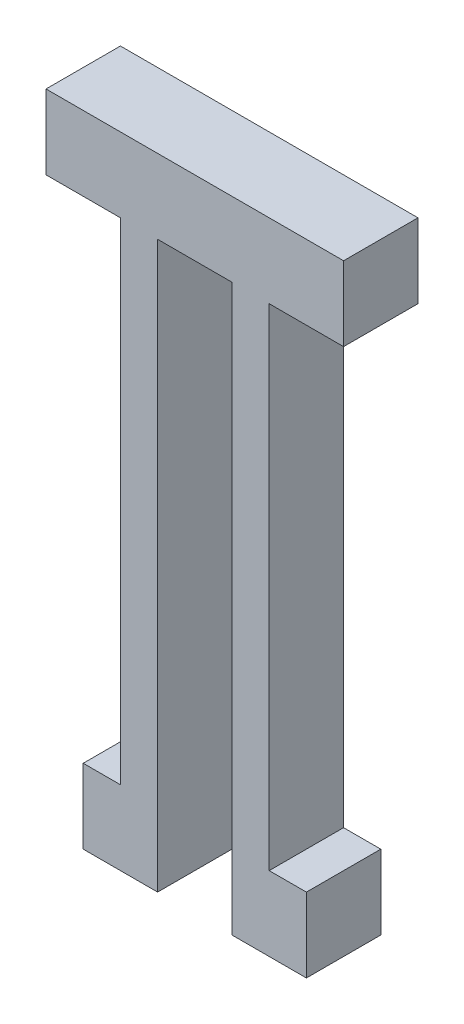
ISO-10303-21;
HEADER;
FILE_DESCRIPTION(('STEP AP214'),'2;1');
FILE_NAME('part.step','',(''),(''),'','','');
FILE_SCHEMA(('AUTOMOTIVE_DESIGN { 1 0 10303 214 1 1 1 1 }'));
ENDSEC;
DATA;
#1=APPLICATION_CONTEXT('core data for automotive mechanical design processes');
#2=APPLICATION_PROTOCOL_DEFINITION('international standard','automotive_design',2000,#1);
#3=PRODUCT_CONTEXT('',#1,'mechanical');
#4=PRODUCT('Part','Part','',(#3));
#5=PRODUCT_RELATED_PRODUCT_CATEGORY('part','',(#4));
#6=PRODUCT_DEFINITION_FORMATION('','',#4);
#7=PRODUCT_DEFINITION_CONTEXT('part definition',#1,'design');
#8=PRODUCT_DEFINITION('design','',#6,#7);
#9=PRODUCT_DEFINITION_SHAPE('','',#8);
#10=(LENGTH_UNIT() NAMED_UNIT(*) SI_UNIT(.MILLI.,.METRE.));
#11=(NAMED_UNIT(*) PLANE_ANGLE_UNIT() SI_UNIT($,.RADIAN.));
#12=(NAMED_UNIT(*) SI_UNIT($,.STERADIAN.) SOLID_ANGLE_UNIT());
#13=UNCERTAINTY_MEASURE_WITH_UNIT(LENGTH_MEASURE(1.E-05),#10,'distance_accuracy_value','');
#14=(GEOMETRIC_REPRESENTATION_CONTEXT(3) GLOBAL_UNCERTAINTY_ASSIGNED_CONTEXT((#13)) GLOBAL_UNIT_ASSIGNED_CONTEXT((#10,
#11,#12)) REPRESENTATION_CONTEXT('',''));
#15=CARTESIAN_POINT('',(0.,0.,0.));
#16=DIRECTION('',(0.,0.,1.));
#17=DIRECTION('',(1.,0.,0.));
#18=AXIS2_PLACEMENT_3D('',#15,#16,#17);
#19=CARTESIAN_POINT('',(0.,0.,6.35));
#20=DIRECTION('',(1.,0.,0.));
#21=DIRECTION('',(0.,0.,-1.));
#22=AXIS2_PLACEMENT_3D('',#19,#20,#21);
#23=PLANE('',#22);
#24=DIRECTION('',(0.,-1.,0.));
#25=VECTOR('',#24,1.);
#26=CARTESIAN_POINT('',(0.,0.,0.));
#27=LINE('',#26,#25);
#28=CARTESIAN_POINT('',(0.,6.34999999999999,0.));
#29=VERTEX_POINT('',#28);
#30=CARTESIAN_POINT('',(0.,0.,0.));
#31=VERTEX_POINT('',#30);
#32=EDGE_CURVE('E177',#29,#31,#27,.T.);
#33=ORIENTED_EDGE('',*,*,#32,.T.);
#34=DIRECTION('',(0.,0.,-1.));
#35=VECTOR('',#34,1.);
#36=CARTESIAN_POINT('',(0.,0.,6.35));
#37=LINE('',#36,#35);
#38=CARTESIAN_POINT('',(0.,0.,6.35));
#39=VERTEX_POINT('',#38);
#40=EDGE_CURVE('E11',#39,#31,#37,.T.);
#41=ORIENTED_EDGE('',*,*,#40,.F.);
#42=DIRECTION('',(0.,-1.,0.));
#43=VECTOR('',#42,1.);
#44=CARTESIAN_POINT('',(0.,0.,6.35));
#45=LINE('',#44,#43);
#46=CARTESIAN_POINT('',(0.,6.34999999999999,6.35));
#47=VERTEX_POINT('',#46);
#48=EDGE_CURVE('E209',#47,#39,#45,.T.);
#49=ORIENTED_EDGE('',*,*,#48,.F.);
#50=DIRECTION('',(0.,0.,-1.));
#51=VECTOR('',#50,1.);
#52=CARTESIAN_POINT('',(0.,6.34999999999999,6.35));
#53=LINE('',#52,#51);
#54=EDGE_CURVE('E173',#47,#29,#53,.T.);
#55=ORIENTED_EDGE('',*,*,#54,.T.);
#56=EDGE_LOOP('',(#33,#41,#49,#55));
#57=FACE_BOUND('',#56,.T.);
#58=ADVANCED_FACE('F33',(#57),#23,.F.);
#59=CARTESIAN_POINT('',(0.,0.,6.35));
#60=DIRECTION('',(0.,1.,0.));
#61=DIRECTION('',(0.,0.,1.));
#62=AXIS2_PLACEMENT_3D('',#59,#60,#61);
#63=PLANE('',#62);
#64=DIRECTION('',(1.,0.,0.));
#65=VECTOR('',#64,1.);
#66=CARTESIAN_POINT('',(0.,0.,0.));
#67=LINE('',#66,#65);
#68=CARTESIAN_POINT('',(6.35,0.,0.));
#69=VERTEX_POINT('',#68);
#70=EDGE_CURVE('E180',#31,#69,#67,.T.);
#71=ORIENTED_EDGE('',*,*,#70,.T.);
#72=DIRECTION('',(0.,0.,-1.));
#73=VECTOR('',#72,1.);
#74=CARTESIAN_POINT('',(6.35,0.,6.35));
#75=LINE('',#74,#73);
#76=CARTESIAN_POINT('',(6.35,0.,6.35));
#77=VERTEX_POINT('',#76);
#78=EDGE_CURVE('E41',#77,#69,#75,.T.);
#79=ORIENTED_EDGE('',*,*,#78,.F.);
#80=DIRECTION('',(1.,0.,0.));
#81=VECTOR('',#80,1.);
#82=CARTESIAN_POINT('',(0.,0.,6.35));
#83=LINE('',#82,#81);
#84=EDGE_CURVE('E116',#39,#77,#83,.T.);
#85=ORIENTED_EDGE('',*,*,#84,.F.);
#86=ORIENTED_EDGE('',*,*,#40,.T.);
#87=EDGE_LOOP('',(#71,#79,#85,#86));
#88=FACE_BOUND('',#87,.T.);
#89=ADVANCED_FACE('F306',(#88),#63,.F.);
#90=CARTESIAN_POINT('',(6.35,0.,6.35));
#91=DIRECTION('',(1.,0.,0.));
#92=DIRECTION('',(0.,1.,0.));
#93=AXIS2_PLACEMENT_3D('',#90,#91,#92);
#94=PLANE('',#93);
#95=DIRECTION('',(0.,-1.,0.));
#96=VECTOR('',#95,1.);
#97=CARTESIAN_POINT('',(6.35,0.,0.));
#98=LINE('',#97,#96);
#99=CARTESIAN_POINT('',(6.35,-41.91,0.));
#100=VERTEX_POINT('',#99);
#101=EDGE_CURVE('E182',#69,#100,#98,.T.);
#102=ORIENTED_EDGE('',*,*,#101,.T.);
#103=DIRECTION('',(0.,0.,-1.));
#104=VECTOR('',#103,1.);
#105=CARTESIAN_POINT('',(6.35,-41.91,6.35));
#106=LINE('',#105,#104);
#107=CARTESIAN_POINT('',(6.35,-41.91,6.35));
#108=VERTEX_POINT('',#107);
#109=EDGE_CURVE('E240',#108,#100,#106,.T.);
#110=ORIENTED_EDGE('',*,*,#109,.F.);
#111=DIRECTION('',(0.,-1.,0.));
#112=VECTOR('',#111,1.);
#113=CARTESIAN_POINT('',(6.35,0.,6.35));
#114=LINE('',#113,#112);
#115=EDGE_CURVE('E248',#77,#108,#114,.T.);
#116=ORIENTED_EDGE('',*,*,#115,.F.);
#117=ORIENTED_EDGE('',*,*,#78,.T.);
#118=EDGE_LOOP('',(#102,#110,#116,#117));
#119=FACE_BOUND('',#118,.T.);
#120=ADVANCED_FACE('F246',(#119),#94,.F.);
#121=CARTESIAN_POINT('',(6.35,-41.91,6.35));
#122=DIRECTION('',(0.,-1.,0.));
#123=DIRECTION('',(0.,0.,-1.));
#124=AXIS2_PLACEMENT_3D('',#121,#122,#123);
#125=PLANE('',#124);
#126=DIRECTION('',(-1.,0.,0.));
#127=VECTOR('',#126,1.);
#128=CARTESIAN_POINT('',(6.35,-41.91,0.));
#129=LINE('',#128,#127);
#130=CARTESIAN_POINT('',(3.175,-41.91,0.));
#131=VERTEX_POINT('',#130);
#132=EDGE_CURVE('E184',#100,#131,#129,.T.);
#133=ORIENTED_EDGE('',*,*,#132,.T.);
#134=DIRECTION('',(0.,0.,-1.));
#135=VECTOR('',#134,1.);
#136=CARTESIAN_POINT('',(3.175,-41.91,6.35));
#137=LINE('',#136,#135);
#138=CARTESIAN_POINT('',(3.175,-41.91,6.35));
#139=VERTEX_POINT('',#138);
#140=EDGE_CURVE('E237',#139,#131,#137,.T.);
#141=ORIENTED_EDGE('',*,*,#140,.F.);
#142=DIRECTION('',(-1.,0.,0.));
#143=VECTOR('',#142,1.);
#144=CARTESIAN_POINT('',(6.35,-41.91,6.35));
#145=LINE('',#144,#143);
#146=EDGE_CURVE('E265',#108,#139,#145,.T.);
#147=ORIENTED_EDGE('',*,*,#146,.F.);
#148=ORIENTED_EDGE('',*,*,#109,.T.);
#149=EDGE_LOOP('',(#133,#141,#147,#148));
#150=FACE_BOUND('',#149,.T.);
#151=ADVANCED_FACE('F256',(#150),#125,.F.);
#152=CARTESIAN_POINT('',(3.175,-41.91,6.35));
#153=DIRECTION('',(1.,0.,0.));
#154=DIRECTION('',(0.,1.,0.));
#155=AXIS2_PLACEMENT_3D('',#152,#153,#154);
#156=PLANE('',#155);
#157=DIRECTION('',(0.,-1.,0.));
#158=VECTOR('',#157,1.);
#159=CARTESIAN_POINT('',(3.175,-41.91,0.));
#160=LINE('',#159,#158);
#161=CARTESIAN_POINT('',(3.17499999999999,-48.26,0.));
#162=VERTEX_POINT('',#161);
#163=EDGE_CURVE('E186',#131,#162,#160,.T.);
#164=ORIENTED_EDGE('',*,*,#163,.T.);
#165=DIRECTION('',(0.,0.,-1.));
#166=VECTOR('',#165,1.);
#167=CARTESIAN_POINT('',(3.17499999999999,-48.26,6.35));
#168=LINE('',#167,#166);
#169=CARTESIAN_POINT('',(3.17499999999999,-48.26,6.35));
#170=VERTEX_POINT('',#169);
#171=EDGE_CURVE('E234',#170,#162,#168,.T.);
#172=ORIENTED_EDGE('',*,*,#171,.F.);
#173=DIRECTION('',(0.,-1.,0.));
#174=VECTOR('',#173,1.);
#175=CARTESIAN_POINT('',(3.175,-41.91,6.35));
#176=LINE('',#175,#174);
#177=EDGE_CURVE('E262',#139,#170,#176,.T.);
#178=ORIENTED_EDGE('',*,*,#177,.F.);
#179=ORIENTED_EDGE('',*,*,#140,.T.);
#180=EDGE_LOOP('',(#164,#172,#178,#179));
#181=FACE_BOUND('',#180,.T.);
#182=ADVANCED_FACE('F260',(#181),#156,.F.);
#183=CARTESIAN_POINT('',(6.34999999999999,-48.26,6.35));
#184=DIRECTION('',(0.,1.,0.));
#185=DIRECTION('',(-1.,0.,0.));
#186=AXIS2_PLACEMENT_3D('',#183,#184,#185);
#187=PLANE('',#186);
#188=DIRECTION('',(1.,0.,0.));
#189=VECTOR('',#188,1.);
#190=CARTESIAN_POINT('',(6.34999999999999,-48.26,0.));
#191=LINE('',#190,#189);
#192=CARTESIAN_POINT('',(9.525,-48.26,0.));
#193=VERTEX_POINT('',#192);
#194=EDGE_CURVE('E189',#162,#193,#191,.T.);
#195=ORIENTED_EDGE('',*,*,#194,.T.);
#196=DIRECTION('',(0.,0.,-1.));
#197=VECTOR('',#196,1.);
#198=CARTESIAN_POINT('',(9.525,-48.26,6.35));
#199=LINE('',#198,#197);
#200=CARTESIAN_POINT('',(9.525,-48.26,6.35));
#201=VERTEX_POINT('',#200);
#202=EDGE_CURVE('E231',#201,#193,#199,.T.);
#203=ORIENTED_EDGE('',*,*,#202,.F.);
#204=DIRECTION('',(1.,0.,0.));
#205=VECTOR('',#204,1.);
#206=CARTESIAN_POINT('',(6.34999999999999,-48.26,6.35));
#207=LINE('',#206,#205);
#208=EDGE_CURVE('E264',#170,#201,#207,.T.);
#209=ORIENTED_EDGE('',*,*,#208,.F.);
#210=ORIENTED_EDGE('',*,*,#171,.T.);
#211=EDGE_LOOP('',(#195,#203,#209,#210));
#212=FACE_BOUND('',#211,.T.);
#213=ADVANCED_FACE('F319',(#212),#187,.F.);
#214=CARTESIAN_POINT('',(9.52499999999999,0.,6.35));
#215=DIRECTION('',(-1.,0.,0.));
#216=DIRECTION('',(0.,-1.,0.));
#217=AXIS2_PLACEMENT_3D('',#214,#215,#216);
#218=PLANE('',#217);
#219=DIRECTION('',(0.,1.,0.));
#220=VECTOR('',#219,1.);
#221=CARTESIAN_POINT('',(9.52499999999999,0.,0.));
#222=LINE('',#221,#220);
#223=CARTESIAN_POINT('',(9.52499999999999,0.,0.));
#224=VERTEX_POINT('',#223);
#225=EDGE_CURVE('E191',#193,#224,#222,.T.);
#226=ORIENTED_EDGE('',*,*,#225,.T.);
#227=DIRECTION('',(0.,0.,-1.));
#228=VECTOR('',#227,1.);
#229=CARTESIAN_POINT('',(9.52499999999999,0.,6.35));
#230=LINE('',#229,#228);
#231=CARTESIAN_POINT('',(9.52499999999999,0.,6.35));
#232=VERTEX_POINT('',#231);
#233=EDGE_CURVE('E228',#232,#224,#230,.T.);
#234=ORIENTED_EDGE('',*,*,#233,.F.);
#235=DIRECTION('',(0.,1.,0.));
#236=VECTOR('',#235,1.);
#237=CARTESIAN_POINT('',(9.52499999999999,0.,6.35));
#238=LINE('',#237,#236);
#239=EDGE_CURVE('E267',#201,#232,#238,.T.);
#240=ORIENTED_EDGE('',*,*,#239,.F.);
#241=ORIENTED_EDGE('',*,*,#202,.T.);
#242=EDGE_LOOP('',(#226,#234,#240,#241));
#243=FACE_BOUND('',#242,.T.);
#244=ADVANCED_FACE('F322',(#243),#218,.F.);
#245=CARTESIAN_POINT('',(9.52499999999999,0.,6.35));
#246=DIRECTION('',(0.,1.,0.));
#247=DIRECTION('',(0.,0.,1.));
#248=AXIS2_PLACEMENT_3D('',#245,#246,#247);
#249=PLANE('',#248);
#250=DIRECTION('',(1.,0.,0.));
#251=VECTOR('',#250,1.);
#252=CARTESIAN_POINT('',(9.52499999999999,0.,0.));
#253=LINE('',#252,#251);
#254=CARTESIAN_POINT('',(15.875,0.,0.));
#255=VERTEX_POINT('',#254);
#256=EDGE_CURVE('E193',#224,#255,#253,.T.);
#257=ORIENTED_EDGE('',*,*,#256,.T.);
#258=DIRECTION('',(0.,0.,-1.));
#259=VECTOR('',#258,1.);
#260=CARTESIAN_POINT('',(15.875,0.,6.35));
#261=LINE('',#260,#259);
#262=CARTESIAN_POINT('',(15.875,0.,6.35));
#263=VERTEX_POINT('',#262);
#264=EDGE_CURVE('E225',#263,#255,#261,.T.);
#265=ORIENTED_EDGE('',*,*,#264,.F.);
#266=DIRECTION('',(1.,0.,0.));
#267=VECTOR('',#266,1.);
#268=CARTESIAN_POINT('',(9.52499999999999,0.,6.35));
#269=LINE('',#268,#267);
#270=EDGE_CURVE('E273',#232,#263,#269,.T.);
#271=ORIENTED_EDGE('',*,*,#270,.F.);
#272=ORIENTED_EDGE('',*,*,#233,.T.);
#273=EDGE_LOOP('',(#257,#265,#271,#272));
#274=FACE_BOUND('',#273,.T.);
#275=ADVANCED_FACE('F326',(#274),#249,.F.);
#276=CARTESIAN_POINT('',(15.875,0.,6.35));
#277=DIRECTION('',(1.,0.,0.));
#278=DIRECTION('',(0.,1.,0.));
#279=AXIS2_PLACEMENT_3D('',#276,#277,#278);
#280=PLANE('',#279);
#281=DIRECTION('',(0.,-1.,0.));
#282=VECTOR('',#281,1.);
#283=CARTESIAN_POINT('',(15.875,0.,0.));
#284=LINE('',#283,#282);
#285=CARTESIAN_POINT('',(15.875,-48.26,0.));
#286=VERTEX_POINT('',#285);
#287=EDGE_CURVE('E195',#255,#286,#284,.T.);
#288=ORIENTED_EDGE('',*,*,#287,.T.);
#289=DIRECTION('',(0.,0.,-1.));
#290=VECTOR('',#289,1.);
#291=CARTESIAN_POINT('',(15.875,-48.26,6.35));
#292=LINE('',#291,#290);
#293=CARTESIAN_POINT('',(15.875,-48.26,6.35));
#294=VERTEX_POINT('',#293);
#295=EDGE_CURVE('E222',#294,#286,#292,.T.);
#296=ORIENTED_EDGE('',*,*,#295,.F.);
#297=DIRECTION('',(0.,-1.,0.));
#298=VECTOR('',#297,1.);
#299=CARTESIAN_POINT('',(15.875,0.,6.35));
#300=LINE('',#299,#298);
#301=EDGE_CURVE('E275',#263,#294,#300,.T.);
#302=ORIENTED_EDGE('',*,*,#301,.F.);
#303=ORIENTED_EDGE('',*,*,#264,.T.);
#304=EDGE_LOOP('',(#288,#296,#302,#303));
#305=FACE_BOUND('',#304,.T.);
#306=ADVANCED_FACE('F330',(#305),#280,.F.);
#307=CARTESIAN_POINT('',(19.05,-48.26,6.35));
#308=DIRECTION('',(0.,1.,0.));
#309=DIRECTION('',(0.,0.,1.));
#310=AXIS2_PLACEMENT_3D('',#307,#308,#309);
#311=PLANE('',#310);
#312=DIRECTION('',(1.,0.,0.));
#313=VECTOR('',#312,1.);
#314=CARTESIAN_POINT('',(19.05,-48.26,0.));
#315=LINE('',#314,#313);
#316=CARTESIAN_POINT('',(22.225,-48.26,0.));
#317=VERTEX_POINT('',#316);
#318=EDGE_CURVE('E198',#286,#317,#315,.T.);
#319=ORIENTED_EDGE('',*,*,#318,.T.);
#320=DIRECTION('',(0.,0.,-1.));
#321=VECTOR('',#320,1.);
#322=CARTESIAN_POINT('',(22.225,-48.26,6.35));
#323=LINE('',#322,#321);
#324=CARTESIAN_POINT('',(22.225,-48.26,6.35));
#325=VERTEX_POINT('',#324);
#326=EDGE_CURVE('E219',#325,#317,#323,.T.);
#327=ORIENTED_EDGE('',*,*,#326,.F.);
#328=DIRECTION('',(1.,0.,0.));
#329=VECTOR('',#328,1.);
#330=CARTESIAN_POINT('',(15.875,-48.26,6.35));
#331=LINE('',#330,#329);
#332=EDGE_CURVE('E277',#294,#325,#331,.T.);
#333=ORIENTED_EDGE('',*,*,#332,.F.);
#334=ORIENTED_EDGE('',*,*,#295,.T.);
#335=EDGE_LOOP('',(#319,#327,#333,#334));
#336=FACE_BOUND('',#335,.T.);
#337=ADVANCED_FACE('F334',(#336),#311,.F.);
#338=CARTESIAN_POINT('',(22.225,-41.91,6.35));
#339=DIRECTION('',(-1.,0.,0.));
#340=DIRECTION('',(0.,-1.,0.));
#341=AXIS2_PLACEMENT_3D('',#338,#339,#340);
#342=PLANE('',#341);
#343=DIRECTION('',(0.,1.,0.));
#344=VECTOR('',#343,1.);
#345=CARTESIAN_POINT('',(22.225,-41.91,0.));
#346=LINE('',#345,#344);
#347=CARTESIAN_POINT('',(22.225,-41.91,0.));
#348=VERTEX_POINT('',#347);
#349=EDGE_CURVE('E200',#317,#348,#346,.T.);
#350=ORIENTED_EDGE('',*,*,#349,.T.);
#351=DIRECTION('',(0.,0.,-1.));
#352=VECTOR('',#351,1.);
#353=CARTESIAN_POINT('',(22.225,-41.91,6.35));
#354=LINE('',#353,#352);
#355=CARTESIAN_POINT('',(22.225,-41.91,6.35));
#356=VERTEX_POINT('',#355);
#357=EDGE_CURVE('E216',#356,#348,#354,.T.);
#358=ORIENTED_EDGE('',*,*,#357,.F.);
#359=DIRECTION('',(0.,1.,0.));
#360=VECTOR('',#359,1.);
#361=CARTESIAN_POINT('',(22.225,-41.91,6.35));
#362=LINE('',#361,#360);
#363=EDGE_CURVE('E279',#325,#356,#362,.T.);
#364=ORIENTED_EDGE('',*,*,#363,.F.);
#365=ORIENTED_EDGE('',*,*,#326,.T.);
#366=EDGE_LOOP('',(#350,#358,#364,#365));
#367=FACE_BOUND('',#366,.T.);
#368=ADVANCED_FACE('F338',(#367),#342,.F.);
#369=CARTESIAN_POINT('',(19.05,-41.91,6.35));
#370=DIRECTION('',(0.,-1.,0.));
#371=DIRECTION('',(0.,0.,-1.));
#372=AXIS2_PLACEMENT_3D('',#369,#370,#371);
#373=PLANE('',#372);
#374=DIRECTION('',(-1.,0.,0.));
#375=VECTOR('',#374,1.);
#376=CARTESIAN_POINT('',(19.05,-41.91,0.));
#377=LINE('',#376,#375);
#378=CARTESIAN_POINT('',(19.05,-41.91,0.));
#379=VERTEX_POINT('',#378);
#380=EDGE_CURVE('E202',#348,#379,#377,.T.);
#381=ORIENTED_EDGE('',*,*,#380,.T.);
#382=DIRECTION('',(0.,0.,-1.));
#383=VECTOR('',#382,1.);
#384=CARTESIAN_POINT('',(19.05,-41.91,6.35));
#385=LINE('',#384,#383);
#386=CARTESIAN_POINT('',(19.05,-41.91,6.35));
#387=VERTEX_POINT('',#386);
#388=EDGE_CURVE('E213',#387,#379,#385,.T.);
#389=ORIENTED_EDGE('',*,*,#388,.F.);
#390=DIRECTION('',(-1.,0.,0.));
#391=VECTOR('',#390,1.);
#392=CARTESIAN_POINT('',(19.05,-41.91,6.35));
#393=LINE('',#392,#391);
#394=EDGE_CURVE('E281',#356,#387,#393,.T.);
#395=ORIENTED_EDGE('',*,*,#394,.F.);
#396=ORIENTED_EDGE('',*,*,#357,.T.);
#397=EDGE_LOOP('',(#381,#389,#395,#396));
#398=FACE_BOUND('',#397,.T.);
#399=ADVANCED_FACE('F287',(#398),#373,.F.);
#400=CARTESIAN_POINT('',(19.05,0.,6.35));
#401=DIRECTION('',(-1.,0.,0.));
#402=DIRECTION('',(0.,-1.,0.));
#403=AXIS2_PLACEMENT_3D('',#400,#401,#402);
#404=PLANE('',#403);
#405=DIRECTION('',(0.,1.,0.));
#406=VECTOR('',#405,1.);
#407=CARTESIAN_POINT('',(19.05,0.,0.));
#408=LINE('',#407,#406);
#409=CARTESIAN_POINT('',(19.05,0.,0.));
#410=VERTEX_POINT('',#409);
#411=EDGE_CURVE('E204',#379,#410,#408,.T.);
#412=ORIENTED_EDGE('',*,*,#411,.T.);
#413=DIRECTION('',(0.,0.,-1.));
#414=VECTOR('',#413,1.);
#415=CARTESIAN_POINT('',(19.05,0.,6.35));
#416=LINE('',#415,#414);
#417=CARTESIAN_POINT('',(19.05,0.,6.35));
#418=VERTEX_POINT('',#417);
#419=EDGE_CURVE('E168',#418,#410,#416,.T.);
#420=ORIENTED_EDGE('',*,*,#419,.F.);
#421=DIRECTION('',(0.,1.,0.));
#422=VECTOR('',#421,1.);
#423=CARTESIAN_POINT('',(19.05,0.,6.35));
#424=LINE('',#423,#422);
#425=EDGE_CURVE('E159',#387,#418,#424,.T.);
#426=ORIENTED_EDGE('',*,*,#425,.F.);
#427=ORIENTED_EDGE('',*,*,#388,.T.);
#428=EDGE_LOOP('',(#412,#420,#426,#427));
#429=FACE_BOUND('',#428,.T.);
#430=ADVANCED_FACE('F291',(#429),#404,.F.);
#431=CARTESIAN_POINT('',(19.05,0.,6.35));
#432=DIRECTION('',(0.,1.,0.));
#433=DIRECTION('',(0.,0.,1.));
#434=AXIS2_PLACEMENT_3D('',#431,#432,#433);
#435=PLANE('',#434);
#436=DIRECTION('',(1.,0.,0.));
#437=VECTOR('',#436,1.);
#438=CARTESIAN_POINT('',(19.05,0.,0.));
#439=LINE('',#438,#437);
#440=CARTESIAN_POINT('',(25.4,0.,0.));
#441=VERTEX_POINT('',#440);
#442=EDGE_CURVE('E167',#410,#441,#439,.T.);
#443=ORIENTED_EDGE('',*,*,#442,.T.);
#444=DIRECTION('',(0.,0.,-1.));
#445=VECTOR('',#444,1.);
#446=CARTESIAN_POINT('',(25.4,0.,6.35));
#447=LINE('',#446,#445);
#448=CARTESIAN_POINT('',(25.4,0.,6.35));
#449=VERTEX_POINT('',#448);
#450=EDGE_CURVE('E164',#449,#441,#447,.T.);
#451=ORIENTED_EDGE('',*,*,#450,.F.);
#452=DIRECTION('',(1.,0.,0.));
#453=VECTOR('',#452,1.);
#454=CARTESIAN_POINT('',(19.05,0.,6.35));
#455=LINE('',#454,#453);
#456=EDGE_CURVE('E153',#418,#449,#455,.T.);
#457=ORIENTED_EDGE('',*,*,#456,.F.);
#458=ORIENTED_EDGE('',*,*,#419,.T.);
#459=EDGE_LOOP('',(#443,#451,#457,#458));
#460=FACE_BOUND('',#459,.T.);
#461=ADVANCED_FACE('F165',(#460),#435,.F.);
#462=CARTESIAN_POINT('',(25.4,0.,6.35));
#463=DIRECTION('',(-1.,0.,0.));
#464=DIRECTION('',(0.,0.,1.));
#465=AXIS2_PLACEMENT_3D('',#462,#463,#464);
#466=PLANE('',#465);
#467=DIRECTION('',(0.,1.,0.));
#468=VECTOR('',#467,1.);
#469=CARTESIAN_POINT('',(25.4,0.,0.));
#470=LINE('',#469,#468);
#471=CARTESIAN_POINT('',(25.4,6.35,0.));
#472=VERTEX_POINT('',#471);
#473=EDGE_CURVE('E102',#441,#472,#470,.T.);
#474=ORIENTED_EDGE('',*,*,#473,.T.);
#475=DIRECTION('',(0.,0.,-1.));
#476=VECTOR('',#475,1.);
#477=CARTESIAN_POINT('',(25.4,6.35,6.35));
#478=LINE('',#477,#476);
#479=CARTESIAN_POINT('',(25.4,6.35,6.35));
#480=VERTEX_POINT('',#479);
#481=EDGE_CURVE('E169',#480,#472,#478,.T.);
#482=ORIENTED_EDGE('',*,*,#481,.F.);
#483=DIRECTION('',(0.,1.,0.));
#484=VECTOR('',#483,1.);
#485=CARTESIAN_POINT('',(25.4,0.,6.35));
#486=LINE('',#485,#484);
#487=EDGE_CURVE('E157',#449,#480,#486,.T.);
#488=ORIENTED_EDGE('',*,*,#487,.F.);
#489=ORIENTED_EDGE('',*,*,#450,.T.);
#490=EDGE_LOOP('',(#474,#482,#488,#489));
#491=FACE_BOUND('',#490,.T.);
#492=ADVANCED_FACE('F171',(#491),#466,.F.);
#493=CARTESIAN_POINT('',(0.,6.34999999999999,6.35));
#494=DIRECTION('',(0.,-1.,0.));
#495=DIRECTION('',(1.,0.,0.));
#496=AXIS2_PLACEMENT_3D('',#493,#494,#495);
#497=PLANE('',#496);
#498=DIRECTION('',(-1.,0.,0.));
#499=VECTOR('',#498,1.);
#500=CARTESIAN_POINT('',(0.,6.34999999999999,0.));
#501=LINE('',#500,#499);
#502=EDGE_CURVE('E108',#472,#29,#501,.T.);
#503=ORIENTED_EDGE('',*,*,#502,.T.);
#504=ORIENTED_EDGE('',*,*,#54,.F.);
#505=DIRECTION('',(-1.,0.,0.));
#506=VECTOR('',#505,1.);
#507=CARTESIAN_POINT('',(0.,6.34999999999999,6.35));
#508=LINE('',#507,#506);
#509=EDGE_CURVE('E49',#480,#47,#508,.T.);
#510=ORIENTED_EDGE('',*,*,#509,.F.);
#511=ORIENTED_EDGE('',*,*,#481,.T.);
#512=EDGE_LOOP('',(#503,#504,#510,#511));
#513=FACE_BOUND('',#512,.T.);
#514=ADVANCED_FACE('F295',(#513),#497,.F.);
#515=CARTESIAN_POINT('',(0.,0.,6.35));
#516=DIRECTION('',(0.,0.,-1.));
#517=DIRECTION('',(-1.,0.,0.));
#518=AXIS2_PLACEMENT_3D('',#515,#516,#517);
#519=PLANE('',#518);
#520=ORIENTED_EDGE('',*,*,#48,.T.);
#521=ORIENTED_EDGE('',*,*,#84,.T.);
#522=ORIENTED_EDGE('',*,*,#115,.T.);
#523=ORIENTED_EDGE('',*,*,#146,.T.);
#524=ORIENTED_EDGE('',*,*,#177,.T.);
#525=ORIENTED_EDGE('',*,*,#208,.T.);
#526=ORIENTED_EDGE('',*,*,#239,.T.);
#527=ORIENTED_EDGE('',*,*,#270,.T.);
#528=ORIENTED_EDGE('',*,*,#301,.T.);
#529=ORIENTED_EDGE('',*,*,#332,.T.);
#530=ORIENTED_EDGE('',*,*,#363,.T.);
#531=ORIENTED_EDGE('',*,*,#394,.T.);
#532=ORIENTED_EDGE('',*,*,#425,.T.);
#533=ORIENTED_EDGE('',*,*,#456,.T.);
#534=ORIENTED_EDGE('',*,*,#487,.T.);
#535=ORIENTED_EDGE('',*,*,#509,.T.);
#536=EDGE_LOOP('',(#520,#521,#522,#523,#524,#525,#526,#527,#528,#529,#530,#531,#532,#533,#534,#535));
#537=FACE_BOUND('',#536,.T.);
#538=ADVANCED_FACE('F155',(#537),#519,.F.);
#539=CARTESIAN_POINT('',(0.,0.,0.));
#540=DIRECTION('',(0.,0.,-1.));
#541=DIRECTION('',(-1.,0.,0.));
#542=AXIS2_PLACEMENT_3D('',#539,#540,#541);
#543=PLANE('',#542);
#544=ORIENTED_EDGE('',*,*,#32,.F.);
#545=ORIENTED_EDGE('',*,*,#502,.F.);
#546=ORIENTED_EDGE('',*,*,#473,.F.);
#547=ORIENTED_EDGE('',*,*,#442,.F.);
#548=ORIENTED_EDGE('',*,*,#411,.F.);
#549=ORIENTED_EDGE('',*,*,#380,.F.);
#550=ORIENTED_EDGE('',*,*,#349,.F.);
#551=ORIENTED_EDGE('',*,*,#318,.F.);
#552=ORIENTED_EDGE('',*,*,#287,.F.);
#553=ORIENTED_EDGE('',*,*,#256,.F.);
#554=ORIENTED_EDGE('',*,*,#225,.F.);
#555=ORIENTED_EDGE('',*,*,#194,.F.);
#556=ORIENTED_EDGE('',*,*,#163,.F.);
#557=ORIENTED_EDGE('',*,*,#132,.F.);
#558=ORIENTED_EDGE('',*,*,#101,.F.);
#559=ORIENTED_EDGE('',*,*,#70,.F.);
#560=EDGE_LOOP('',(#544,#545,#546,#547,#548,#549,#550,#551,#552,#553,#554,#555,#556,#557,#558,#559));
#561=FACE_BOUND('',#560,.T.);
#562=ADVANCED_FACE('F252',(#561),#543,.T.);
#563=CLOSED_SHELL('',(#58,#89,#120,#151,#182,#213,#244,#275,#306,#337,#368,#399,#430,#461,#492,
#514,#538,#562));
#564=MANIFOLD_SOLID_BREP('B2',#563);
#565=ADVANCED_BREP_SHAPE_REPRESENTATION('',(#18,#564),#14);
#566=SHAPE_DEFINITION_REPRESENTATION(#9,#565);
ENDSEC;
END-ISO-10303-21;
